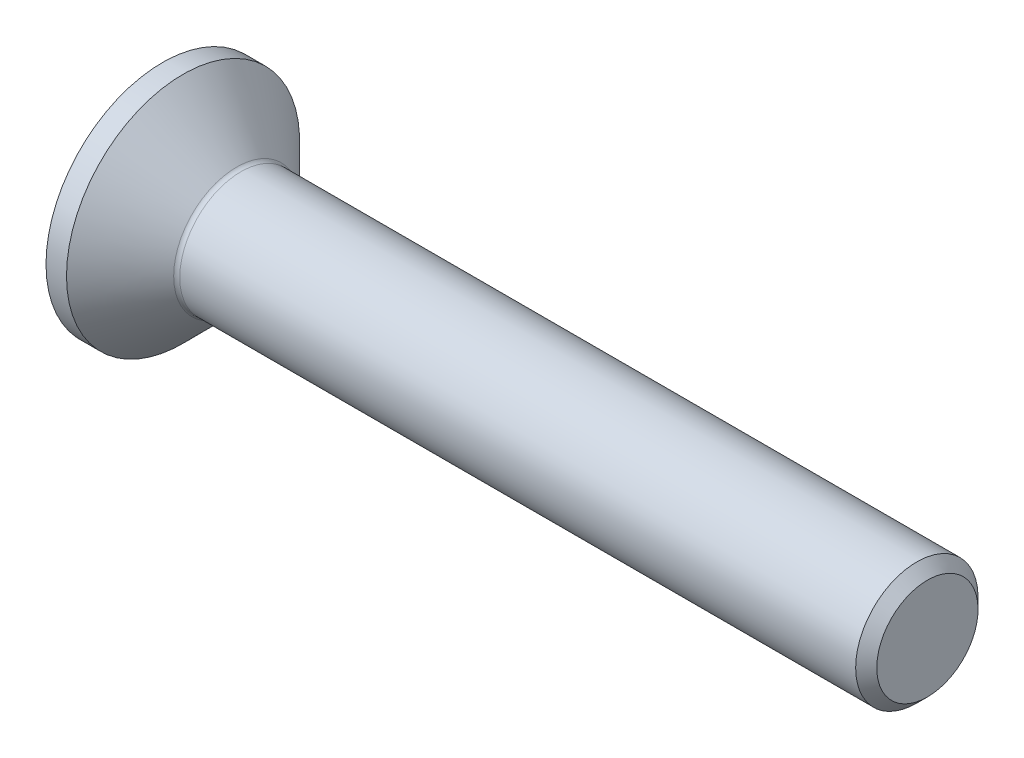
ISO-10303-21;
HEADER;
FILE_DESCRIPTION(('STEP AP214'),'2;1');
FILE_NAME('part.step','',(''),(''),'','','');
FILE_SCHEMA(('AUTOMOTIVE_DESIGN { 1 0 10303 214 1 1 1 1 }'));
ENDSEC;
DATA;
#1=APPLICATION_CONTEXT('core data for automotive mechanical design processes');
#2=APPLICATION_PROTOCOL_DEFINITION('international standard','automotive_design',2000,#1);
#3=PRODUCT_CONTEXT('',#1,'mechanical');
#4=PRODUCT('Part','Part','',(#3));
#5=PRODUCT_RELATED_PRODUCT_CATEGORY('part','',(#4));
#6=PRODUCT_DEFINITION_FORMATION('','',#4);
#7=PRODUCT_DEFINITION_CONTEXT('part definition',#1,'design');
#8=PRODUCT_DEFINITION('design','',#6,#7);
#9=PRODUCT_DEFINITION_SHAPE('','',#8);
#10=(LENGTH_UNIT() NAMED_UNIT(*) SI_UNIT(.MILLI.,.METRE.));
#11=(NAMED_UNIT(*) PLANE_ANGLE_UNIT() SI_UNIT($,.RADIAN.));
#12=(NAMED_UNIT(*) SI_UNIT($,.STERADIAN.) SOLID_ANGLE_UNIT());
#13=UNCERTAINTY_MEASURE_WITH_UNIT(LENGTH_MEASURE(1.E-05),#10,'distance_accuracy_value','');
#14=(GEOMETRIC_REPRESENTATION_CONTEXT(3) GLOBAL_UNCERTAINTY_ASSIGNED_CONTEXT((#13)) GLOBAL_UNIT_ASSIGNED_CONTEXT((#10,
#11,#12)) REPRESENTATION_CONTEXT('',''));
#15=CARTESIAN_POINT('',(0.,0.,0.));
#16=DIRECTION('',(0.,0.,1.));
#17=DIRECTION('',(1.,0.,0.));
#18=AXIS2_PLACEMENT_3D('',#15,#16,#17);
#19=CARTESIAN_POINT('',(3.00000000004275,0.,0.));
#20=DIRECTION('',(-1.,0.,0.));
#21=DIRECTION('',(0.,-1.,0.));
#22=AXIS2_PLACEMENT_3D('',#19,#20,#21);
#23=CONICAL_SURFACE('',#22,2.49999999999773,1.04719755120245);
#24=CARTESIAN_POINT('',(4.44337567299158,0.,-5.6843418860808E-11));
#25=VERTEX_POINT('',#24);
#26=VERTEX_LOOP('',#25);
#27=FACE_BOUND('',#26,.T.);
#28=CARTESIAN_POINT('',(3.00000000004275,0.,0.));
#29=DIRECTION('',(-1.,0.,0.));
#30=DIRECTION('',(0.,-1.,0.));
#31=AXIS2_PLACEMENT_3D('',#28,#29,#30);
#32=CIRCLE('',#31,2.49999999999773);
#33=CARTESIAN_POINT('',(3.00000000002137,2.16506350946011,-1.24999999999943));
#34=VERTEX_POINT('',#33);
#35=CARTESIAN_POINT('',(3.00000000002137,0.,-2.49999999999886));
#36=VERTEX_POINT('',#35);
#37=EDGE_CURVE('E91',#34,#36,#32,.T.);
#38=ORIENTED_EDGE('',*,*,#37,.T.);
#39=CARTESIAN_POINT('',(3.00000000004275,0.,0.));
#40=DIRECTION('',(-1.,0.,0.));
#41=DIRECTION('',(0.,-1.,0.));
#42=AXIS2_PLACEMENT_3D('',#39,#40,#41);
#43=CIRCLE('',#42,2.49999999999773);
#44=CARTESIAN_POINT('',(3.00000000002137,-2.16506350946011,-1.24999999999943));
#45=VERTEX_POINT('',#44);
#46=EDGE_CURVE('E87',#36,#45,#43,.T.);
#47=ORIENTED_EDGE('',*,*,#46,.T.);
#48=CARTESIAN_POINT('',(3.00000000004275,0.,0.));
#49=DIRECTION('',(-1.,0.,0.));
#50=DIRECTION('',(0.,-1.,0.));
#51=AXIS2_PLACEMENT_3D('',#48,#49,#50);
#52=CIRCLE('',#51,2.49999999999773);
#53=CARTESIAN_POINT('',(3.00000000002137,-2.16506350946011,1.24999999999943));
#54=VERTEX_POINT('',#53);
#55=EDGE_CURVE('E20',#45,#54,#52,.T.);
#56=ORIENTED_EDGE('',*,*,#55,.T.);
#57=CARTESIAN_POINT('',(3.00000000004275,0.,0.));
#58=DIRECTION('',(-1.,0.,0.));
#59=DIRECTION('',(0.,-1.,0.));
#60=AXIS2_PLACEMENT_3D('',#57,#58,#59);
#61=CIRCLE('',#60,2.49999999999773);
#62=CARTESIAN_POINT('',(3.00000000002137,0.,2.49999999999886));
#63=VERTEX_POINT('',#62);
#64=EDGE_CURVE('E146',#54,#63,#61,.T.);
#65=ORIENTED_EDGE('',*,*,#64,.T.);
#66=CARTESIAN_POINT('',(3.00000000004275,0.,0.));
#67=DIRECTION('',(-1.,0.,0.));
#68=DIRECTION('',(0.,-1.,0.));
#69=AXIS2_PLACEMENT_3D('',#66,#67,#68);
#70=CIRCLE('',#69,2.49999999999773);
#71=CARTESIAN_POINT('',(3.00000000002137,2.16506350946011,1.24999999999943));
#72=VERTEX_POINT('',#71);
#73=EDGE_CURVE('E148',#63,#72,#70,.T.);
#74=ORIENTED_EDGE('',*,*,#73,.T.);
#75=CARTESIAN_POINT('',(3.00000000004275,0.,0.));
#76=DIRECTION('',(-1.,0.,0.));
#77=DIRECTION('',(0.,-1.,0.));
#78=AXIS2_PLACEMENT_3D('',#75,#76,#77);
#79=CIRCLE('',#78,2.49999999999773);
#80=EDGE_CURVE('E150',#72,#34,#79,.T.);
#81=ORIENTED_EDGE('',*,*,#80,.T.);
#82=EDGE_LOOP('',(#38,#47,#56,#65,#74,#81));
#83=FACE_BOUND('',#82,.T.);
#84=ADVANCED_FACE('F17',(#27,#83),#23,.F.);
#85=CARTESIAN_POINT('',(3.,0.,-5.));
#86=DIRECTION('',(1.,0.,0.));
#87=DIRECTION('',(0.,0.,-1.));
#88=AXIS2_PLACEMENT_3D('',#85,#86,#87);
#89=PLANE('',#88);
#90=DIRECTION('',(0.,0.5,0.866025403784439));
#91=VECTOR('',#90,1.);
#92=CARTESIAN_POINT('',(3.,-1.44337567297406,2.5));
#93=LINE('',#92,#91);
#94=CARTESIAN_POINT('',(3.,-2.88675134594813,0.));
#95=VERTEX_POINT('',#94);
#96=EDGE_CURVE('E103',#54,#95,#93,.F.);
#97=ORIENTED_EDGE('',*,*,#96,.F.);
#98=ORIENTED_EDGE('',*,*,#55,.F.);
#99=DIRECTION('',(0.,-0.5,0.866025403784438));
#100=VECTOR('',#99,1.);
#101=CARTESIAN_POINT('',(3.,-2.88675134594813,0.));
#102=LINE('',#101,#100);
#103=EDGE_CURVE('E101',#95,#45,#102,.F.);
#104=ORIENTED_EDGE('',*,*,#103,.F.);
#105=EDGE_LOOP('',(#97,#98,#104));
#106=FACE_BOUND('',#105,.T.);
#107=ADVANCED_FACE('F99',(#106),#89,.F.);
#108=CARTESIAN_POINT('',(3.,0.,-5.));
#109=DIRECTION('',(1.,0.,0.));
#110=DIRECTION('',(0.,0.,-1.));
#111=AXIS2_PLACEMENT_3D('',#108,#109,#110);
#112=PLANE('',#111);
#113=DIRECTION('',(0.,-0.5,0.866025403784438));
#114=VECTOR('',#113,1.);
#115=CARTESIAN_POINT('',(3.,-2.88675134594813,0.));
#116=LINE('',#115,#114);
#117=CARTESIAN_POINT('',(3.,-1.44337567297406,-2.5));
#118=VERTEX_POINT('',#117);
#119=EDGE_CURVE('E105',#45,#118,#116,.F.);
#120=ORIENTED_EDGE('',*,*,#119,.F.);
#121=ORIENTED_EDGE('',*,*,#46,.F.);
#122=DIRECTION('',(0.,-1.,0.));
#123=VECTOR('',#122,1.);
#124=CARTESIAN_POINT('',(3.,-1.44337567297406,-2.5));
#125=LINE('',#124,#123);
#126=EDGE_CURVE('E108',#118,#36,#125,.F.);
#127=ORIENTED_EDGE('',*,*,#126,.F.);
#128=EDGE_LOOP('',(#120,#121,#127));
#129=FACE_BOUND('',#128,.T.);
#130=ADVANCED_FACE('F106',(#129),#112,.F.);
#131=CARTESIAN_POINT('',(3.,0.,-5.));
#132=DIRECTION('',(1.,0.,0.));
#133=DIRECTION('',(0.,0.,-1.));
#134=AXIS2_PLACEMENT_3D('',#131,#132,#133);
#135=PLANE('',#134);
#136=DIRECTION('',(0.,-1.,0.));
#137=VECTOR('',#136,1.);
#138=CARTESIAN_POINT('',(3.,-1.44337567297406,-2.5));
#139=LINE('',#138,#137);
#140=CARTESIAN_POINT('',(3.,1.44337567297406,-2.5));
#141=VERTEX_POINT('',#140);
#142=EDGE_CURVE('E164',#36,#141,#139,.F.);
#143=ORIENTED_EDGE('',*,*,#142,.F.);
#144=ORIENTED_EDGE('',*,*,#37,.F.);
#145=DIRECTION('',(0.,-0.5,-0.866025403784439));
#146=VECTOR('',#145,1.);
#147=CARTESIAN_POINT('',(3.,1.44337567297407,-2.5));
#148=LINE('',#147,#146);
#149=EDGE_CURVE('E162',#141,#34,#148,.F.);
#150=ORIENTED_EDGE('',*,*,#149,.F.);
#151=EDGE_LOOP('',(#143,#144,#150));
#152=FACE_BOUND('',#151,.T.);
#153=ADVANCED_FACE('F160',(#152),#135,.F.);
#154=CARTESIAN_POINT('',(3.,0.,-5.));
#155=DIRECTION('',(1.,0.,0.));
#156=DIRECTION('',(0.,0.,-1.));
#157=AXIS2_PLACEMENT_3D('',#154,#155,#156);
#158=PLANE('',#157);
#159=DIRECTION('',(0.,-0.5,-0.866025403784439));
#160=VECTOR('',#159,1.);
#161=CARTESIAN_POINT('',(3.,1.44337567297407,-2.5));
#162=LINE('',#161,#160);
#163=CARTESIAN_POINT('',(3.,2.88675134594813,0.));
#164=VERTEX_POINT('',#163);
#165=EDGE_CURVE('E165',#34,#164,#162,.F.);
#166=ORIENTED_EDGE('',*,*,#165,.F.);
#167=ORIENTED_EDGE('',*,*,#80,.F.);
#168=DIRECTION('',(0.,0.5,-0.866025403784439));
#169=VECTOR('',#168,1.);
#170=CARTESIAN_POINT('',(3.,2.88675134594813,0.));
#171=LINE('',#170,#169);
#172=EDGE_CURVE('E168',#164,#72,#171,.F.);
#173=ORIENTED_EDGE('',*,*,#172,.F.);
#174=EDGE_LOOP('',(#166,#167,#173));
#175=FACE_BOUND('',#174,.T.);
#176=ADVANCED_FACE('F166',(#175),#158,.F.);
#177=CARTESIAN_POINT('',(3.,0.,-5.));
#178=DIRECTION('',(1.,0.,0.));
#179=DIRECTION('',(0.,0.,-1.));
#180=AXIS2_PLACEMENT_3D('',#177,#178,#179);
#181=PLANE('',#180);
#182=DIRECTION('',(0.,0.5,-0.866025403784439));
#183=VECTOR('',#182,1.);
#184=CARTESIAN_POINT('',(3.,2.88675134594813,0.));
#185=LINE('',#184,#183);
#186=CARTESIAN_POINT('',(3.,1.44337567297406,2.5));
#187=VERTEX_POINT('',#186);
#188=EDGE_CURVE('E224',#72,#187,#185,.F.);
#189=ORIENTED_EDGE('',*,*,#188,.F.);
#190=ORIENTED_EDGE('',*,*,#73,.F.);
#191=DIRECTION('',(0.,1.,0.));
#192=VECTOR('',#191,1.);
#193=CARTESIAN_POINT('',(3.,1.44337567297407,2.5));
#194=LINE('',#193,#192);
#195=EDGE_CURVE('E236',#187,#63,#194,.F.);
#196=ORIENTED_EDGE('',*,*,#195,.F.);
#197=EDGE_LOOP('',(#189,#190,#196));
#198=FACE_BOUND('',#197,.T.);
#199=ADVANCED_FACE('F304',(#198),#181,.F.);
#200=CARTESIAN_POINT('',(3.,0.,-5.));
#201=DIRECTION('',(1.,0.,0.));
#202=DIRECTION('',(0.,0.,-1.));
#203=AXIS2_PLACEMENT_3D('',#200,#201,#202);
#204=PLANE('',#203);
#205=DIRECTION('',(0.,1.,0.));
#206=VECTOR('',#205,1.);
#207=CARTESIAN_POINT('',(3.,1.44337567297407,2.5));
#208=LINE('',#207,#206);
#209=CARTESIAN_POINT('',(3.,-1.44337567297406,2.5));
#210=VERTEX_POINT('',#209);
#211=EDGE_CURVE('E244',#63,#210,#208,.F.);
#212=ORIENTED_EDGE('',*,*,#211,.F.);
#213=ORIENTED_EDGE('',*,*,#64,.F.);
#214=DIRECTION('',(0.,0.5,0.866025403784439));
#215=VECTOR('',#214,1.);
#216=CARTESIAN_POINT('',(3.,-1.44337567297406,2.5));
#217=LINE('',#216,#215);
#218=EDGE_CURVE('E127',#210,#54,#217,.F.);
#219=ORIENTED_EDGE('',*,*,#218,.F.);
#220=EDGE_LOOP('',(#212,#213,#219));
#221=FACE_BOUND('',#220,.T.);
#222=ADVANCED_FACE('F300',(#221),#204,.F.);
#223=CARTESIAN_POINT('',(3.,-1.44337567297406,2.5));
#224=DIRECTION('',(0.,0.866025403784439,-0.5));
#225=DIRECTION('',(0.,0.5,0.866025403784439));
#226=AXIS2_PLACEMENT_3D('',#223,#224,#225);
#227=PLANE('',#226);
#228=ORIENTED_EDGE('',*,*,#96,.T.);
#229=DIRECTION('',(1.,0.,0.));
#230=VECTOR('',#229,1.);
#231=CARTESIAN_POINT('',(3.,-2.88675134594813,0.));
#232=LINE('',#231,#230);
#233=CARTESIAN_POINT('',(0.,-2.88675134594813,0.));
#234=VERTEX_POINT('',#233);
#235=EDGE_CURVE('E115',#234,#95,#232,.T.);
#236=ORIENTED_EDGE('',*,*,#235,.F.);
#237=DIRECTION('',(0.,-0.5,-0.866025403784439));
#238=VECTOR('',#237,1.);
#239=CARTESIAN_POINT('',(0.,-1.44337567297406,2.5));
#240=LINE('',#239,#238);
#241=CARTESIAN_POINT('',(0.,-1.44337567297406,2.5));
#242=VERTEX_POINT('',#241);
#243=EDGE_CURVE('E130',#242,#234,#240,.T.);
#244=ORIENTED_EDGE('',*,*,#243,.F.);
#245=DIRECTION('',(-1.,0.,0.));
#246=VECTOR('',#245,1.);
#247=CARTESIAN_POINT('',(3.,-1.44337567297406,2.5));
#248=LINE('',#247,#246);
#249=EDGE_CURVE('E134',#210,#242,#248,.T.);
#250=ORIENTED_EDGE('',*,*,#249,.F.);
#251=ORIENTED_EDGE('',*,*,#218,.T.);
#252=EDGE_LOOP('',(#228,#236,#244,#250,#251));
#253=FACE_BOUND('',#252,.T.);
#254=ADVANCED_FACE('F297',(#253),#227,.T.);
#255=CARTESIAN_POINT('',(3.,-2.88675134594813,0.));
#256=DIRECTION('',(0.,0.866025403784438,0.5));
#257=DIRECTION('',(0.,-0.5,0.866025403784438));
#258=AXIS2_PLACEMENT_3D('',#255,#256,#257);
#259=PLANE('',#258);
#260=ORIENTED_EDGE('',*,*,#119,.T.);
#261=DIRECTION('',(1.,0.,0.));
#262=VECTOR('',#261,1.);
#263=CARTESIAN_POINT('',(3.,-1.44337567297406,-2.5));
#264=LINE('',#263,#262);
#265=CARTESIAN_POINT('',(0.,-1.44337567297406,-2.5));
#266=VERTEX_POINT('',#265);
#267=EDGE_CURVE('E111',#266,#118,#264,.T.);
#268=ORIENTED_EDGE('',*,*,#267,.F.);
#269=DIRECTION('',(0.,0.5,-0.866025403784439));
#270=VECTOR('',#269,1.);
#271=CARTESIAN_POINT('',(0.,-2.88675134594813,0.));
#272=LINE('',#271,#270);
#273=EDGE_CURVE('E133',#234,#266,#272,.T.);
#274=ORIENTED_EDGE('',*,*,#273,.F.);
#275=ORIENTED_EDGE('',*,*,#235,.T.);
#276=ORIENTED_EDGE('',*,*,#103,.T.);
#277=EDGE_LOOP('',(#260,#268,#274,#275,#276));
#278=FACE_BOUND('',#277,.T.);
#279=ADVANCED_FACE('F113',(#278),#259,.T.);
#280=CARTESIAN_POINT('',(3.,-1.44337567297406,-2.5));
#281=DIRECTION('',(0.,0.,1.));
#282=DIRECTION('',(0.,-1.,0.));
#283=AXIS2_PLACEMENT_3D('',#280,#281,#282);
#284=PLANE('',#283);
#285=ORIENTED_EDGE('',*,*,#142,.T.);
#286=DIRECTION('',(1.,0.,0.));
#287=VECTOR('',#286,1.);
#288=CARTESIAN_POINT('',(3.,1.44337567297407,-2.5));
#289=LINE('',#288,#287);
#290=CARTESIAN_POINT('',(0.,1.44337567297407,-2.5));
#291=VERTEX_POINT('',#290);
#292=EDGE_CURVE('E175',#291,#141,#289,.T.);
#293=ORIENTED_EDGE('',*,*,#292,.F.);
#294=DIRECTION('',(0.,1.,0.));
#295=VECTOR('',#294,1.);
#296=CARTESIAN_POINT('',(0.,0.,-2.5));
#297=LINE('',#296,#295);
#298=EDGE_CURVE('E189',#266,#291,#297,.T.);
#299=ORIENTED_EDGE('',*,*,#298,.F.);
#300=ORIENTED_EDGE('',*,*,#267,.T.);
#301=ORIENTED_EDGE('',*,*,#126,.T.);
#302=EDGE_LOOP('',(#285,#293,#299,#300,#301));
#303=FACE_BOUND('',#302,.T.);
#304=ADVANCED_FACE('F212',(#303),#284,.T.);
#305=CARTESIAN_POINT('',(3.,1.44337567297407,-2.5));
#306=DIRECTION('',(0.,-0.866025403784439,0.5));
#307=DIRECTION('',(0.,-0.5,-0.866025403784439));
#308=AXIS2_PLACEMENT_3D('',#305,#306,#307);
#309=PLANE('',#308);
#310=ORIENTED_EDGE('',*,*,#165,.T.);
#311=DIRECTION('',(1.,0.,0.));
#312=VECTOR('',#311,1.);
#313=CARTESIAN_POINT('',(3.,2.88675134594813,0.));
#314=LINE('',#313,#312);
#315=CARTESIAN_POINT('',(0.,2.88675134594813,0.));
#316=VERTEX_POINT('',#315);
#317=EDGE_CURVE('E171',#316,#164,#314,.T.);
#318=ORIENTED_EDGE('',*,*,#317,.F.);
#319=DIRECTION('',(0.,0.5,0.866025403784439));
#320=VECTOR('',#319,1.);
#321=CARTESIAN_POINT('',(0.,1.44337567297407,-2.5));
#322=LINE('',#321,#320);
#323=EDGE_CURVE('E192',#291,#316,#322,.T.);
#324=ORIENTED_EDGE('',*,*,#323,.F.);
#325=ORIENTED_EDGE('',*,*,#292,.T.);
#326=ORIENTED_EDGE('',*,*,#149,.T.);
#327=EDGE_LOOP('',(#310,#318,#324,#325,#326));
#328=FACE_BOUND('',#327,.T.);
#329=ADVANCED_FACE('F173',(#328),#309,.T.);
#330=CARTESIAN_POINT('',(3.,2.88675134594813,0.));
#331=DIRECTION('',(0.,-0.866025403784439,-0.5));
#332=DIRECTION('',(0.,0.5,-0.866025403784439));
#333=AXIS2_PLACEMENT_3D('',#330,#331,#332);
#334=PLANE('',#333);
#335=ORIENTED_EDGE('',*,*,#188,.T.);
#336=DIRECTION('',(-1.,0.,0.));
#337=VECTOR('',#336,1.);
#338=CARTESIAN_POINT('',(3.,1.44337567297407,2.5));
#339=LINE('',#338,#337);
#340=CARTESIAN_POINT('',(0.,1.44337567297407,2.5));
#341=VERTEX_POINT('',#340);
#342=EDGE_CURVE('E35',#341,#187,#339,.F.);
#343=ORIENTED_EDGE('',*,*,#342,.F.);
#344=DIRECTION('',(0.,-0.5,0.866025403784439));
#345=VECTOR('',#344,1.);
#346=CARTESIAN_POINT('',(0.,2.88675134594813,0.));
#347=LINE('',#346,#345);
#348=EDGE_CURVE('E213',#316,#341,#347,.T.);
#349=ORIENTED_EDGE('',*,*,#348,.F.);
#350=ORIENTED_EDGE('',*,*,#317,.T.);
#351=ORIENTED_EDGE('',*,*,#172,.T.);
#352=EDGE_LOOP('',(#335,#343,#349,#350,#351));
#353=FACE_BOUND('',#352,.T.);
#354=ADVANCED_FACE('F287',(#353),#334,.T.);
#355=CARTESIAN_POINT('',(3.,1.44337567297407,2.5));
#356=DIRECTION('',(0.,0.,-1.));
#357=DIRECTION('',(-1.,0.,0.));
#358=AXIS2_PLACEMENT_3D('',#355,#356,#357);
#359=PLANE('',#358);
#360=ORIENTED_EDGE('',*,*,#211,.T.);
#361=ORIENTED_EDGE('',*,*,#249,.T.);
#362=DIRECTION('',(0.,1.,0.));
#363=VECTOR('',#362,1.);
#364=CARTESIAN_POINT('',(0.,0.,2.5));
#365=LINE('',#364,#363);
#366=EDGE_CURVE('E145',#341,#242,#365,.F.);
#367=ORIENTED_EDGE('',*,*,#366,.F.);
#368=ORIENTED_EDGE('',*,*,#342,.T.);
#369=ORIENTED_EDGE('',*,*,#195,.T.);
#370=EDGE_LOOP('',(#360,#361,#367,#368,#369));
#371=FACE_BOUND('',#370,.T.);
#372=ADVANCED_FACE('F284',(#371),#359,.T.);
#373=CARTESIAN_POINT('',(0.,0.,0.));
#374=DIRECTION('',(-1.,0.,0.));
#375=DIRECTION('',(0.,0.,1.));
#376=AXIS2_PLACEMENT_3D('',#373,#374,#375);
#377=PLANE('',#376);
#378=ORIENTED_EDGE('',*,*,#348,.T.);
#379=ORIENTED_EDGE('',*,*,#366,.T.);
#380=ORIENTED_EDGE('',*,*,#243,.T.);
#381=ORIENTED_EDGE('',*,*,#273,.T.);
#382=ORIENTED_EDGE('',*,*,#298,.T.);
#383=ORIENTED_EDGE('',*,*,#323,.T.);
#384=EDGE_LOOP('',(#378,#379,#380,#381,#382,#383));
#385=FACE_BOUND('',#384,.T.);
#386=CARTESIAN_POINT('',(0.,0.,0.));
#387=DIRECTION('',(-1.,0.,0.));
#388=DIRECTION('',(0.,0.,1.));
#389=AXIS2_PLACEMENT_3D('',#386,#387,#388);
#390=CIRCLE('',#389,7.62);
#391=CARTESIAN_POINT('',(0.,0.,7.62));
#392=VERTEX_POINT('',#391);
#393=EDGE_CURVE('E142',#392,#392,#390,.F.);
#394=ORIENTED_EDGE('',*,*,#393,.F.);
#395=EDGE_LOOP('',(#394));
#396=FACE_BOUND('',#395,.T.);
#397=ADVANCED_FACE('F205',(#385,#396),#377,.T.);
#398=CARTESIAN_POINT('',(0.,0.,0.));
#399=DIRECTION('',(-1.,0.,0.));
#400=DIRECTION('',(0.,0.,1.));
#401=AXIS2_PLACEMENT_3D('',#398,#399,#400);
#402=CYLINDRICAL_SURFACE('',#401,7.62);
#403=ORIENTED_EDGE('',*,*,#393,.T.);
#404=EDGE_LOOP('',(#403));
#405=FACE_BOUND('',#404,.T.);
#406=CARTESIAN_POINT('',(1.34000000000002,0.,0.));
#407=DIRECTION('',(-1.,0.,0.));
#408=DIRECTION('',(0.,0.,1.));
#409=AXIS2_PLACEMENT_3D('',#406,#407,#408);
#410=CIRCLE('',#409,7.62);
#411=CARTESIAN_POINT('',(1.34000000000002,0.,7.62));
#412=VERTEX_POINT('',#411);
#413=EDGE_CURVE('E141',#412,#412,#410,.F.);
#414=ORIENTED_EDGE('',*,*,#413,.F.);
#415=EDGE_LOOP('',(#414));
#416=FACE_BOUND('',#415,.T.);
#417=ADVANCED_FACE('F277',(#405,#416),#402,.T.);
#418=CARTESIAN_POINT('',(50.,3.3095,0.));
#419=DIRECTION('',(1.,0.,0.));
#420=DIRECTION('',(0.,0.,-1.));
#421=AXIS2_PLACEMENT_3D('',#418,#419,#420);
#422=PLANE('',#421);
#423=CARTESIAN_POINT('',(49.9999999999545,0.,0.));
#424=DIRECTION('',(-1.,0.,0.));
#425=DIRECTION('',(0.,-1.,0.));
#426=AXIS2_PLACEMENT_3D('',#423,#424,#425);
#427=CIRCLE('',#426,3.30950000005714);
#428=CARTESIAN_POINT('',(49.9999999999545,-3.30950000005714,0.));
#429=VERTEX_POINT('',#428);
#430=EDGE_CURVE('E137',#429,#429,#427,.T.);
#431=ORIENTED_EDGE('',*,*,#430,.F.);
#432=EDGE_LOOP('',(#431));
#433=FACE_BOUND('',#432,.T.);
#434=ADVANCED_FACE('F273',(#433),#422,.T.);
#435=CARTESIAN_POINT('',(1.34000000000002,0.,0.));
#436=DIRECTION('',(-1.,0.,0.));
#437=DIRECTION('',(0.,-1.,0.));
#438=AXIS2_PLACEMENT_3D('',#435,#436,#437);
#439=CONICAL_SURFACE('',#438,7.62,0.78539816339745);
#440=ORIENTED_EDGE('',*,*,#413,.T.);
#441=EDGE_LOOP('',(#440));
#442=FACE_BOUND('',#441,.T.);
#443=CARTESIAN_POINT('',(4.84284271247468,0.,0.));
#444=DIRECTION('',(-1.,0.,0.));
#445=DIRECTION('',(0.,0.,1.));
#446=AXIS2_PLACEMENT_3D('',#443,#444,#445);
#447=CIRCLE('',#446,4.11715728752532);
#448=CARTESIAN_POINT('',(4.84284271247468,0.,4.11715728752532));
#449=VERTEX_POINT('',#448);
#450=EDGE_CURVE('E140',#449,#449,#447,.T.);
#451=ORIENTED_EDGE('',*,*,#450,.T.);
#452=EDGE_LOOP('',(#451));
#453=FACE_BOUND('',#452,.T.);
#454=ADVANCED_FACE('F269',(#442,#453),#439,.T.);
#455=CARTESIAN_POINT('',(49.3095000001063,0.,0.));
#456=DIRECTION('',(-1.,0.,0.));
#457=DIRECTION('',(0.,-1.,0.));
#458=AXIS2_PLACEMENT_3D('',#455,#456,#457);
#459=CONICAL_SURFACE('',#458,3.99999999996226,0.785398163438609);
#460=CARTESIAN_POINT('',(49.3094999999999,0.,0.));
#461=DIRECTION('',(-1.,0.,0.));
#462=DIRECTION('',(0.,0.,1.));
#463=AXIS2_PLACEMENT_3D('',#460,#461,#462);
#464=CIRCLE('',#463,3.99999999999994);
#465=CARTESIAN_POINT('',(49.3094999999999,0.,3.99999999999994));
#466=VERTEX_POINT('',#465);
#467=EDGE_CURVE('E26',#466,#466,#464,.T.);
#468=ORIENTED_EDGE('',*,*,#467,.F.);
#469=EDGE_LOOP('',(#468));
#470=FACE_BOUND('',#469,.T.);
#471=ORIENTED_EDGE('',*,*,#430,.T.);
#472=EDGE_LOOP('',(#471));
#473=FACE_BOUND('',#472,.T.);
#474=ADVANCED_FACE('F265',(#470,#473),#459,.T.);
#475=CARTESIAN_POINT('',(5.1256854249493,0.,0.));
#476=DIRECTION('',(-1.,0.,0.));
#477=DIRECTION('',(0.,0.,1.));
#478=AXIS2_PLACEMENT_3D('',#475,#476,#477);
#479=TOROIDAL_SURFACE('',#478,4.39999999999994,0.4);
#480=ORIENTED_EDGE('',*,*,#450,.F.);
#481=EDGE_LOOP('',(#480));
#482=FACE_BOUND('',#481,.T.);
#483=CARTESIAN_POINT('',(5.1256854249493,0.,0.));
#484=DIRECTION('',(-1.,0.,0.));
#485=DIRECTION('',(0.,0.,1.));
#486=AXIS2_PLACEMENT_3D('',#483,#484,#485);
#487=CIRCLE('',#486,3.99999999999994);
#488=CARTESIAN_POINT('',(5.1256854249493,0.,3.99999999999994));
#489=VERTEX_POINT('',#488);
#490=EDGE_CURVE('E11',#489,#489,#487,.F.);
#491=ORIENTED_EDGE('',*,*,#490,.F.);
#492=EDGE_LOOP('',(#491));
#493=FACE_BOUND('',#492,.T.);
#494=ADVANCED_FACE('F260',(#482,#493),#479,.F.);
#495=CARTESIAN_POINT('',(0.,0.,0.));
#496=DIRECTION('',(-1.,0.,0.));
#497=DIRECTION('',(0.,0.,1.));
#498=AXIS2_PLACEMENT_3D('',#495,#496,#497);
#499=CYLINDRICAL_SURFACE('',#498,3.99999999999994);
#500=ORIENTED_EDGE('',*,*,#490,.T.);
#501=EDGE_LOOP('',(#500));
#502=FACE_BOUND('',#501,.T.);
#503=ORIENTED_EDGE('',*,*,#467,.T.);
#504=EDGE_LOOP('',(#503));
#505=FACE_BOUND('',#504,.T.);
#506=ADVANCED_FACE('F264',(#502,#505),#499,.T.);
#507=CLOSED_SHELL('',(#84,#107,#130,#153,#176,#199,#222,#254,#279,#304,#329,#354,#372,#397,#417,
#434,#454,#474,#494,#506));
#508=MANIFOLD_SOLID_BREP('B1',#507);
#509=ADVANCED_BREP_SHAPE_REPRESENTATION('',(#18,#508),#14);
#510=SHAPE_DEFINITION_REPRESENTATION(#9,#509);
ENDSEC;
END-ISO-10303-21;
